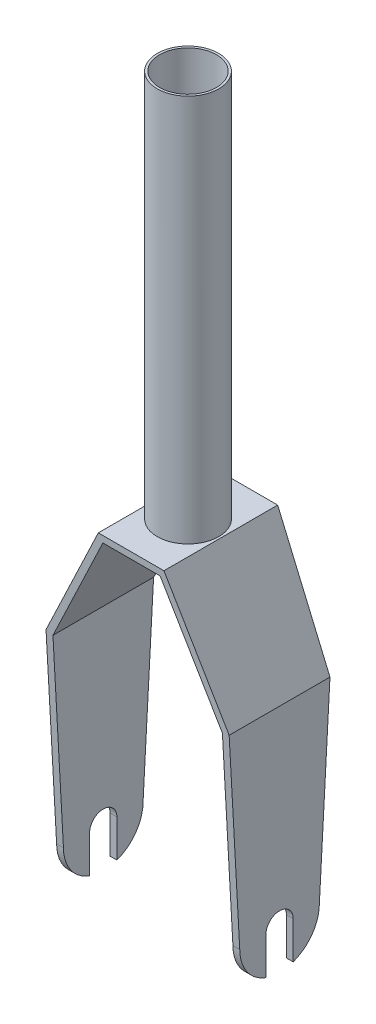
ISO-10303-21;
HEADER;
FILE_DESCRIPTION(('STEP AP214'),'2;1');
FILE_NAME('part.step','',(''),(''),'','','');
FILE_SCHEMA(('AUTOMOTIVE_DESIGN { 1 0 10303 214 1 1 1 1 }'));
ENDSEC;
DATA;
#1=APPLICATION_CONTEXT('core data for automotive mechanical design processes');
#2=APPLICATION_PROTOCOL_DEFINITION('international standard','automotive_design',2000,#1);
#3=PRODUCT_CONTEXT('',#1,'mechanical');
#4=PRODUCT('Part','Part','',(#3));
#5=PRODUCT_RELATED_PRODUCT_CATEGORY('part','',(#4));
#6=PRODUCT_DEFINITION_FORMATION('','',#4);
#7=PRODUCT_DEFINITION_CONTEXT('part definition',#1,'design');
#8=PRODUCT_DEFINITION('design','',#6,#7);
#9=PRODUCT_DEFINITION_SHAPE('','',#8);
#10=(LENGTH_UNIT() NAMED_UNIT(*) SI_UNIT(.MILLI.,.METRE.));
#11=(NAMED_UNIT(*) PLANE_ANGLE_UNIT() SI_UNIT($,.RADIAN.));
#12=(NAMED_UNIT(*) SI_UNIT($,.STERADIAN.) SOLID_ANGLE_UNIT());
#13=UNCERTAINTY_MEASURE_WITH_UNIT(LENGTH_MEASURE(1.E-05),#10,'distance_accuracy_value','');
#14=(GEOMETRIC_REPRESENTATION_CONTEXT(3) GLOBAL_UNCERTAINTY_ASSIGNED_CONTEXT((#13)) GLOBAL_UNIT_ASSIGNED_CONTEXT((#10,
#11,#12)) REPRESENTATION_CONTEXT('',''));
#15=CARTESIAN_POINT('',(0.,0.,0.));
#16=DIRECTION('',(0.,0.,1.));
#17=DIRECTION('',(1.,0.,0.));
#18=AXIS2_PLACEMENT_3D('',#15,#16,#17);
#19=CARTESIAN_POINT('',(14.6152103221235,1.49999999998596,25.));
#20=DIRECTION('',(0.,1.,0.));
#21=DIRECTION('',(-1.,0.,0.));
#22=AXIS2_PLACEMENT_3D('',#19,#20,#21);
#23=PLANE('',#22);
#24=DIRECTION('',(-1.,0.,0.));
#25=VECTOR('',#24,1.);
#26=CARTESIAN_POINT('',(14.6152103221235,1.49999999998596,24.8334082598536));
#27=LINE('',#26,#25);
#28=CARTESIAN_POINT('',(12.577081525325,1.49999999998596,24.8334082598536));
#29=VERTEX_POINT('',#28);
#30=CARTESIAN_POINT('',(-12.577081525325,1.49999999998596,24.8334082598536));
#31=VERTEX_POINT('',#30);
#32=EDGE_CURVE('E428',#29,#31,#27,.T.);
#33=ORIENTED_EDGE('',*,*,#32,.T.);
#34=DIRECTION('',(0.,0.,-1.));
#35=VECTOR('',#34,1.);
#36=CARTESIAN_POINT('',(-12.577081525325,1.49999999998596,25.));
#37=LINE('',#36,#35);
#38=CARTESIAN_POINT('',(-12.577081525325,1.49999999998596,4.90581494813335));
#39=VERTEX_POINT('',#38);
#40=EDGE_CURVE('E409',#31,#39,#37,.T.);
#41=ORIENTED_EDGE('',*,*,#40,.T.);
#42=CARTESIAN_POINT('',(0.,1.49999999998596,0.));
#43=DIRECTION('',(0.,1.,0.));
#44=DIRECTION('',(-1.,0.,0.));
#45=AXIS2_PLACEMENT_3D('',#42,#43,#44);
#46=CIRCLE('',#45,13.5);
#47=CARTESIAN_POINT('',(12.577081525325,1.49999999998596,4.90581494813333));
#48=VERTEX_POINT('',#47);
#49=EDGE_CURVE('E375',#39,#48,#46,.T.);
#50=ORIENTED_EDGE('',*,*,#49,.T.);
#51=DIRECTION('',(0.,0.,1.));
#52=VECTOR('',#51,1.);
#53=CARTESIAN_POINT('',(12.577081525325,1.49999999998596,25.));
#54=LINE('',#53,#52);
#55=EDGE_CURVE('E458',#48,#29,#54,.T.);
#56=ORIENTED_EDGE('',*,*,#55,.T.);
#57=EDGE_LOOP('',(#33,#41,#50,#56));
#58=FACE_BOUND('',#57,.T.);
#59=ADVANCED_FACE('F207',(#58),#23,.F.);
#60=CARTESIAN_POINT('',(-12.577081525325,1.49999999998596,-4.90581494813333));
#61=VERTEX_POINT('',#60);
#62=CARTESIAN_POINT('',(-12.577081525325,1.49999999998597,-24.8334082598536));
#63=VERTEX_POINT('',#62);
#64=EDGE_CURVE('E542',#61,#63,#37,.T.);
#65=ORIENTED_EDGE('',*,*,#64,.T.);
#66=DIRECTION('',(1.,0.,0.));
#67=VECTOR('',#66,1.);
#68=CARTESIAN_POINT('',(14.6152103221235,1.49999999998596,-24.8334082598536));
#69=LINE('',#68,#67);
#70=CARTESIAN_POINT('',(12.577081525325,1.49999999998596,-24.8334082598536));
#71=VERTEX_POINT('',#70);
#72=EDGE_CURVE('E438',#63,#71,#69,.T.);
#73=ORIENTED_EDGE('',*,*,#72,.T.);
#74=CARTESIAN_POINT('',(12.577081525325,1.49999999998596,-4.90581494813333));
#75=VERTEX_POINT('',#74);
#76=EDGE_CURVE('E456',#71,#75,#54,.T.);
#77=ORIENTED_EDGE('',*,*,#76,.T.);
#78=EDGE_CURVE('E464',#75,#61,#46,.T.);
#79=ORIENTED_EDGE('',*,*,#78,.T.);
#80=EDGE_LOOP('',(#65,#73,#77,#79));
#81=FACE_BOUND('',#80,.T.);
#82=ADVANCED_FACE('F576',(#81),#23,.F.);
#83=CARTESIAN_POINT('',(-40.3111828379217,-46.7638898282595,25.));
#84=DIRECTION('',(0.892634794614373,-0.450780571280259,0.));
#85=DIRECTION('',(0.450780571280259,0.892634794614373,0.));
#86=AXIS2_PLACEMENT_3D('',#83,#84,#85);
#87=PLANE('',#86);
#88=DIRECTION('',(0.450227796999917,0.891540192079043,-0.0495077440029718));
#89=VECTOR('',#88,1.);
#90=CARTESIAN_POINT('',(-41.362218395057,-48.8451483572402,-22.0377129689337));
#91=LINE('',#90,#89);
#92=CARTESIAN_POINT('',(-40.249999999986,-46.6427356937333,-22.1600142216451));
#93=VERTEX_POINT('',#92);
#94=CARTESIAN_POINT('',(-14.4229184746577,4.49999999998597,-25.));
#95=VERTEX_POINT('',#94);
#96=EDGE_CURVE('E534',#93,#95,#91,.T.);
#97=ORIENTED_EDGE('',*,*,#96,.F.);
#98=DIRECTION('',(0.,0.,1.));
#99=VECTOR('',#98,1.);
#100=CARTESIAN_POINT('',(-40.249999999986,-46.6427356937333,25.));
#101=LINE('',#100,#99);
#102=CARTESIAN_POINT('',(-40.249999999986,-46.6427356937333,22.1600142216451));
#103=VERTEX_POINT('',#102);
#104=EDGE_CURVE('E405',#93,#103,#101,.T.);
#105=ORIENTED_EDGE('',*,*,#104,.T.);
#106=DIRECTION('',(-0.450227796999917,-0.891540192079043,-0.0495077440029718));
#107=VECTOR('',#106,1.);
#108=CARTESIAN_POINT('',(-40.2477302692123,-46.6382411773497,22.1602638047469));
#109=LINE('',#108,#107);
#110=CARTESIAN_POINT('',(-14.4229184746576,4.49999999998597,25.));
#111=VERTEX_POINT('',#110);
#112=EDGE_CURVE('E537',#111,#103,#109,.T.);
#113=ORIENTED_EDGE('',*,*,#112,.F.);
#114=DIRECTION('',(0.,0.,1.));
#115=VECTOR('',#114,1.);
#116=CARTESIAN_POINT('',(-14.4229184746577,4.49999999998597,25.));
#117=LINE('',#116,#115);
#118=EDGE_CURVE('E539',#95,#111,#117,.T.);
#119=ORIENTED_EDGE('',*,*,#118,.F.);
#120=EDGE_LOOP('',(#97,#105,#113,#119));
#121=FACE_BOUND('',#120,.T.);
#122=ADVANCED_FACE('F612',(#121),#87,.F.);
#123=CARTESIAN_POINT('',(-37.6332784540786,-48.1162315421003,25.));
#124=DIRECTION('',(-0.892634794614373,0.450780571280259,0.));
#125=DIRECTION('',(-0.450780571280259,-0.892634794614373,0.));
#126=AXIS2_PLACEMENT_3D('',#123,#124,#125);
#127=PLANE('',#126);
#128=DIRECTION('',(-0.450227796999917,-0.891540192079043,0.0495077440029718));
#129=VECTOR('',#128,1.);
#130=CARTESIAN_POINT('',(-38.6826401320797,-50.1941754589343,-21.9628007114751));
#131=LINE('',#130,#129);
#132=CARTESIAN_POINT('',(-37.249999999986,-47.3572643062734,-22.1203360333293));
#133=VERTEX_POINT('',#132);
#134=EDGE_CURVE('E535',#63,#133,#131,.T.);
#135=ORIENTED_EDGE('',*,*,#134,.F.);
#136=ORIENTED_EDGE('',*,*,#64,.F.);
#137=CARTESIAN_POINT('',(0.,26.4051119313226,0.));
#138=DIRECTION('',(-0.892634794614373,0.450780571280259,0.));
#139=DIRECTION('',(-0.450780571280259,-0.892634794614373,0.));
#140=AXIS2_PLACEMENT_3D('',#137,#138,#139);
#141=ELLIPSE('',#140,29.9480520237568,13.5);
#142=CARTESIAN_POINT('',(-13.3345815253179,0.,-2.1068781513534));
#143=VERTEX_POINT('',#142);
#144=EDGE_CURVE('E379',#61,#143,#141,.T.);
#145=ORIENTED_EDGE('',*,*,#144,.T.);
#146=DIRECTION('',(0.,0.,1.));
#147=VECTOR('',#146,1.);
#148=CARTESIAN_POINT('',(-13.3345815253179,0.,0.));
#149=LINE('',#148,#147);
#150=CARTESIAN_POINT('',(-13.3345815253179,0.,2.1068781513534));
#151=VERTEX_POINT('',#150);
#152=EDGE_CURVE('E385',#143,#151,#149,.T.);
#153=ORIENTED_EDGE('',*,*,#152,.T.);
#154=EDGE_CURVE('E369',#151,#39,#141,.T.);
#155=ORIENTED_EDGE('',*,*,#154,.T.);
#156=ORIENTED_EDGE('',*,*,#40,.F.);
#157=DIRECTION('',(0.450227796999917,0.891540192079043,0.0495077440029718));
#158=VECTOR('',#157,1.);
#159=CARTESIAN_POINT('',(-37.5681520062351,-47.9872682790438,22.0853515472883));
#160=LINE('',#159,#158);
#161=CARTESIAN_POINT('',(-37.249999999986,-47.3572643062734,22.1203360333293));
#162=VERTEX_POINT('',#161);
#163=EDGE_CURVE('E538',#162,#31,#160,.T.);
#164=ORIENTED_EDGE('',*,*,#163,.F.);
#165=DIRECTION('',(0.,0.,-1.));
#166=VECTOR('',#165,1.);
#167=CARTESIAN_POINT('',(-37.249999999986,-47.3572643062733,25.));
#168=LINE('',#167,#166);
#169=EDGE_CURVE('E399',#162,#133,#168,.T.);
#170=ORIENTED_EDGE('',*,*,#169,.T.);
#171=EDGE_LOOP('',(#135,#136,#145,#153,#155,#156,#164,#170));
#172=FACE_BOUND('',#171,.T.);
#173=ADVANCED_FACE('F395',(#172),#127,.F.);
#174=CARTESIAN_POINT('',(0.,0.,0.));
#175=DIRECTION('',(0.,1.,0.));
#176=DIRECTION('',(0.,0.,1.));
#177=AXIS2_PLACEMENT_3D('',#174,#175,#176);
#178=PLANE('',#177);
#179=CARTESIAN_POINT('',(0.,0.,0.));
#180=DIRECTION('',(0.,1.,0.));
#181=DIRECTION('',(0.,0.,1.));
#182=AXIS2_PLACEMENT_3D('',#179,#180,#181);
#183=CIRCLE('',#182,12.5);
#184=CARTESIAN_POINT('',(0.,0.,12.5));
#185=VERTEX_POINT('',#184);
#186=EDGE_CURVE('E467',#185,#185,#183,.T.);
#187=ORIENTED_EDGE('',*,*,#186,.T.);
#188=EDGE_LOOP('',(#187));
#189=FACE_BOUND('',#188,.T.);
#190=ORIENTED_EDGE('',*,*,#152,.F.);
#191=CARTESIAN_POINT('',(0.,0.,0.));
#192=DIRECTION('',(0.,1.,0.));
#193=DIRECTION('',(0.,0.,1.));
#194=AXIS2_PLACEMENT_3D('',#191,#192,#193);
#195=CIRCLE('',#194,13.5);
#196=CARTESIAN_POINT('',(13.3345815253179,0.,-2.1068781513534));
#197=VERTEX_POINT('',#196);
#198=EDGE_CURVE('E390',#197,#143,#195,.T.);
#199=ORIENTED_EDGE('',*,*,#198,.F.);
#200=DIRECTION('',(0.,0.,-1.));
#201=VECTOR('',#200,1.);
#202=CARTESIAN_POINT('',(13.3345815253179,0.,0.));
#203=LINE('',#202,#201);
#204=CARTESIAN_POINT('',(13.3345815253179,0.,2.1068781513534));
#205=VERTEX_POINT('',#204);
#206=EDGE_CURVE('E388',#205,#197,#203,.T.);
#207=ORIENTED_EDGE('',*,*,#206,.F.);
#208=EDGE_CURVE('E372',#151,#205,#195,.T.);
#209=ORIENTED_EDGE('',*,*,#208,.F.);
#210=EDGE_LOOP('',(#190,#199,#207,#209));
#211=FACE_BOUND('',#210,.T.);
#212=ADVANCED_FACE('F383',(#189,#211),#178,.F.);
#213=CARTESIAN_POINT('',(0.,175.,0.));
#214=DIRECTION('',(0.,-1.,0.));
#215=DIRECTION('',(0.,0.,-1.));
#216=AXIS2_PLACEMENT_3D('',#213,#214,#215);
#217=CYLINDRICAL_SURFACE('',#216,13.5);
#218=CARTESIAN_POINT('',(0.,175.,0.));
#219=DIRECTION('',(0.,1.,0.));
#220=DIRECTION('',(0.,0.,1.));
#221=AXIS2_PLACEMENT_3D('',#218,#219,#220);
#222=CIRCLE('',#221,13.5);
#223=CARTESIAN_POINT('',(0.,175.,13.5));
#224=VERTEX_POINT('',#223);
#225=EDGE_CURVE('E472',#224,#224,#222,.T.);
#226=ORIENTED_EDGE('',*,*,#225,.F.);
#227=EDGE_LOOP('',(#226));
#228=FACE_BOUND('',#227,.T.);
#229=CARTESIAN_POINT('',(0.,4.49999999998596,0.));
#230=DIRECTION('',(0.,-1.,0.));
#231=DIRECTION('',(1.,0.,0.));
#232=AXIS2_PLACEMENT_3D('',#229,#230,#231);
#233=CIRCLE('',#232,13.5);
#234=CARTESIAN_POINT('',(13.5,4.49999999998596,0.));
#235=VERTEX_POINT('',#234);
#236=EDGE_CURVE('E452',#235,#235,#233,.T.);
#237=ORIENTED_EDGE('',*,*,#236,.F.);
#238=EDGE_LOOP('',(#237));
#239=FACE_BOUND('',#238,.T.);
#240=ADVANCED_FACE('F209',(#228,#239),#217,.T.);
#241=ORIENTED_EDGE('',*,*,#144,.F.);
#242=ORIENTED_EDGE('',*,*,#78,.F.);
#243=CARTESIAN_POINT('',(0.,26.4051119313226,0.));
#244=DIRECTION('',(0.892634794614373,0.450780571280259,0.));
#245=DIRECTION('',(0.450780571280259,-0.892634794614373,0.));
#246=AXIS2_PLACEMENT_3D('',#243,#244,#245);
#247=ELLIPSE('',#246,29.9480520237568,13.5);
#248=EDGE_CURVE('E474',#197,#75,#247,.T.);
#249=ORIENTED_EDGE('',*,*,#248,.F.);
#250=ORIENTED_EDGE('',*,*,#198,.T.);
#251=EDGE_LOOP('',(#241,#242,#249,#250));
#252=FACE_BOUND('',#251,.T.);
#253=ADVANCED_FACE('F635',(#252),#217,.T.);
#254=ORIENTED_EDGE('',*,*,#49,.F.);
#255=ORIENTED_EDGE('',*,*,#154,.F.);
#256=ORIENTED_EDGE('',*,*,#208,.T.);
#257=EDGE_CURVE('E478',#48,#205,#247,.T.);
#258=ORIENTED_EDGE('',*,*,#257,.F.);
#259=EDGE_LOOP('',(#254,#255,#256,#258));
#260=FACE_BOUND('',#259,.T.);
#261=ADVANCED_FACE('F371',(#260),#217,.T.);
#262=CARTESIAN_POINT('',(0.,175.,0.));
#263=DIRECTION('',(0.,-1.,0.));
#264=DIRECTION('',(0.,0.,-1.));
#265=AXIS2_PLACEMENT_3D('',#262,#263,#264);
#266=CYLINDRICAL_SURFACE('',#265,12.5);
#267=CARTESIAN_POINT('',(0.,175.,0.));
#268=DIRECTION('',(0.,1.,0.));
#269=DIRECTION('',(0.,0.,1.));
#270=AXIS2_PLACEMENT_3D('',#267,#268,#269);
#271=CIRCLE('',#270,12.5);
#272=CARTESIAN_POINT('',(0.,175.,12.5));
#273=VERTEX_POINT('',#272);
#274=EDGE_CURVE('E391',#273,#273,#271,.T.);
#275=ORIENTED_EDGE('',*,*,#274,.T.);
#276=EDGE_LOOP('',(#275));
#277=FACE_BOUND('',#276,.T.);
#278=ORIENTED_EDGE('',*,*,#186,.F.);
#279=EDGE_LOOP('',(#278));
#280=FACE_BOUND('',#279,.T.);
#281=ADVANCED_FACE('F673',(#277,#280),#266,.F.);
#282=CARTESIAN_POINT('',(40.249999999986,-147.,25.));
#283=DIRECTION('',(-1.,0.,0.));
#284=DIRECTION('',(0.,-1.,0.));
#285=AXIS2_PLACEMENT_3D('',#282,#283,#284);
#286=PLANE('',#285);
#287=CARTESIAN_POINT('',(40.249999999986,-130.560717777209,2.45113194250125E-11));
#288=DIRECTION('',(1.,0.,0.));
#289=DIRECTION('',(0.,1.,0.));
#290=AXIS2_PLACEMENT_3D('',#287,#288,#289);
#291=CIRCLE('',#290,17.5000000000329);
#292=CARTESIAN_POINT('',(40.249999999986,-147.000000000009,-5.99999999997549));
#293=VERTEX_POINT('',#292);
#294=CARTESIAN_POINT('',(40.249999999986,-130.560717777354,-17.5000000000165));
#295=VERTEX_POINT('',#294);
#296=EDGE_CURVE('E439',#293,#295,#291,.T.);
#297=ORIENTED_EDGE('',*,*,#296,.T.);
#298=DIRECTION('',(0.,0.998461734026933,-0.0554451592470507));
#299=VECTOR('',#298,1.);
#300=CARTESIAN_POINT('',(40.249999999986,-149.302257391145,-16.459271434255));
#301=LINE('',#300,#299);
#302=CARTESIAN_POINT('',(40.249999999986,-46.6427356937333,-22.1600142216451));
#303=VERTEX_POINT('',#302);
#304=EDGE_CURVE('E442',#295,#303,#301,.T.);
#305=ORIENTED_EDGE('',*,*,#304,.T.);
#306=DIRECTION('',(0.,0.,-1.));
#307=VECTOR('',#306,1.);
#308=CARTESIAN_POINT('',(40.249999999986,-46.6427356937333,25.));
#309=LINE('',#308,#307);
#310=CARTESIAN_POINT('',(40.249999999986,-46.6427356937333,22.1600142216451));
#311=VERTEX_POINT('',#310);
#312=EDGE_CURVE('E453',#311,#303,#309,.T.);
#313=ORIENTED_EDGE('',*,*,#312,.F.);
#314=DIRECTION('',(0.,-0.998461734026933,-0.0554451592470507));
#315=VECTOR('',#314,1.);
#316=CARTESIAN_POINT('',(40.249999999986,-146.534263898885,16.6129797184515));
#317=LINE('',#316,#315);
#318=CARTESIAN_POINT('',(40.249999999986,-130.560717777209,17.5000000000245));
#319=VERTEX_POINT('',#318);
#320=EDGE_CURVE('E430',#311,#319,#317,.T.);
#321=ORIENTED_EDGE('',*,*,#320,.T.);
#322=CARTESIAN_POINT('',(40.249999999986,-130.560717777209,2.45113194250125E-11));
#323=DIRECTION('',(1.,0.,0.));
#324=DIRECTION('',(0.,1.,0.));
#325=AXIS2_PLACEMENT_3D('',#322,#323,#324);
#326=CIRCLE('',#325,17.5);
#327=CARTESIAN_POINT('',(40.249999999986,-147.,5.99999999997549));
#328=VERTEX_POINT('',#327);
#329=EDGE_CURVE('E434',#319,#328,#326,.T.);
#330=ORIENTED_EDGE('',*,*,#329,.T.);
#331=DIRECTION('',(0.,-1.,0.));
#332=VECTOR('',#331,1.);
#333=CARTESIAN_POINT('',(40.249999999986,0.,5.99999999997551));
#334=LINE('',#333,#332);
#335=CARTESIAN_POINT('',(40.249999999986,-130.560717777209,5.99999999997549));
#336=VERTEX_POINT('',#335);
#337=EDGE_CURVE('E509',#336,#328,#334,.T.);
#338=ORIENTED_EDGE('',*,*,#337,.F.);
#339=CARTESIAN_POINT('',(40.249999999986,-130.560717777209,2.45113194250125E-11));
#340=DIRECTION('',(1.,0.,0.));
#341=DIRECTION('',(0.,1.,0.));
#342=AXIS2_PLACEMENT_3D('',#339,#340,#341);
#343=CIRCLE('',#342,5.99999999997549);
#344=CARTESIAN_POINT('',(40.249999999986,-130.560717777209,-5.99999999997549));
#345=VERTEX_POINT('',#344);
#346=EDGE_CURVE('E511',#345,#336,#343,.T.);
#347=ORIENTED_EDGE('',*,*,#346,.F.);
#348=DIRECTION('',(0.,-1.,0.));
#349=VECTOR('',#348,1.);
#350=CARTESIAN_POINT('',(40.249999999986,-147.,-5.99999999997549));
#351=LINE('',#350,#349);
#352=EDGE_CURVE('E513',#345,#293,#351,.T.);
#353=ORIENTED_EDGE('',*,*,#352,.T.);
#354=EDGE_LOOP('',(#297,#305,#313,#321,#330,#338,#347,#353));
#355=FACE_BOUND('',#354,.T.);
#356=ADVANCED_FACE('F622',(#355),#286,.F.);
#357=CARTESIAN_POINT('',(37.249999999986,-147.,25.));
#358=DIRECTION('',(1.,0.,0.));
#359=DIRECTION('',(0.,1.,0.));
#360=AXIS2_PLACEMENT_3D('',#357,#358,#359);
#361=PLANE('',#360);
#362=DIRECTION('',(0.,0.,1.));
#363=VECTOR('',#362,1.);
#364=CARTESIAN_POINT('',(37.249999999986,-47.3572643062733,25.));
#365=LINE('',#364,#363);
#366=CARTESIAN_POINT('',(37.249999999986,-47.3572643062734,-22.1203360333293));
#367=VERTEX_POINT('',#366);
#368=CARTESIAN_POINT('',(37.249999999986,-47.3572643062733,22.1203360333293));
#369=VERTEX_POINT('',#368);
#370=EDGE_CURVE('E449',#367,#369,#365,.T.);
#371=ORIENTED_EDGE('',*,*,#370,.F.);
#372=DIRECTION('',(0.,-0.998461734026933,0.0554451592470507));
#373=VECTOR('',#372,1.);
#374=CARTESIAN_POINT('',(37.249999999986,-149.302257391145,-16.459271434255));
#375=LINE('',#374,#373);
#376=CARTESIAN_POINT('',(37.249999999986,-130.560717777209,-17.5000000000245));
#377=VERTEX_POINT('',#376);
#378=EDGE_CURVE('E380',#367,#377,#375,.T.);
#379=ORIENTED_EDGE('',*,*,#378,.T.);
#380=CARTESIAN_POINT('',(37.249999999986,-130.560717777209,2.45113194250125E-11));
#381=DIRECTION('',(1.,0.,0.));
#382=DIRECTION('',(0.,1.,0.));
#383=AXIS2_PLACEMENT_3D('',#380,#381,#382);
#384=CIRCLE('',#383,17.5000000000329);
#385=CARTESIAN_POINT('',(37.249999999986,-147.,-5.99999999997549));
#386=VERTEX_POINT('',#385);
#387=EDGE_CURVE('E492',#386,#377,#384,.T.);
#388=ORIENTED_EDGE('',*,*,#387,.F.);
#389=DIRECTION('',(0.,-1.,0.));
#390=VECTOR('',#389,1.);
#391=CARTESIAN_POINT('',(37.249999999986,-147.,-5.99999999997549));
#392=LINE('',#391,#390);
#393=CARTESIAN_POINT('',(37.249999999986,-130.560717777209,-5.99999999997549));
#394=VERTEX_POINT('',#393);
#395=EDGE_CURVE('E490',#394,#386,#392,.T.);
#396=ORIENTED_EDGE('',*,*,#395,.F.);
#397=CARTESIAN_POINT('',(37.249999999986,-130.560717777209,2.45113194250125E-11));
#398=DIRECTION('',(1.,0.,0.));
#399=DIRECTION('',(0.,1.,0.));
#400=AXIS2_PLACEMENT_3D('',#397,#398,#399);
#401=CIRCLE('',#400,5.99999999997549);
#402=CARTESIAN_POINT('',(37.249999999986,-130.560717777209,5.99999999997549));
#403=VERTEX_POINT('',#402);
#404=EDGE_CURVE('E487',#394,#403,#401,.T.);
#405=ORIENTED_EDGE('',*,*,#404,.T.);
#406=DIRECTION('',(0.,-1.,0.));
#407=VECTOR('',#406,1.);
#408=CARTESIAN_POINT('',(37.249999999986,-147.,5.99999999997549));
#409=LINE('',#408,#407);
#410=CARTESIAN_POINT('',(37.249999999986,-147.,5.99999999997549));
#411=VERTEX_POINT('',#410);
#412=EDGE_CURVE('E484',#403,#411,#409,.T.);
#413=ORIENTED_EDGE('',*,*,#412,.T.);
#414=CARTESIAN_POINT('',(37.249999999986,-130.560717777209,2.45113194250125E-11));
#415=DIRECTION('',(1.,0.,0.));
#416=DIRECTION('',(0.,1.,0.));
#417=AXIS2_PLACEMENT_3D('',#414,#415,#416);
#418=CIRCLE('',#417,17.5);
#419=CARTESIAN_POINT('',(37.249999999986,-130.560717777209,17.5000000000245));
#420=VERTEX_POINT('',#419);
#421=EDGE_CURVE('E482',#420,#411,#418,.T.);
#422=ORIENTED_EDGE('',*,*,#421,.F.);
#423=DIRECTION('',(0.,0.998461734026933,0.0554451592470507));
#424=VECTOR('',#423,1.);
#425=CARTESIAN_POINT('',(37.249999999986,-146.534263898885,16.6129797184515));
#426=LINE('',#425,#424);
#427=EDGE_CURVE('E479',#420,#369,#426,.T.);
#428=ORIENTED_EDGE('',*,*,#427,.T.);
#429=EDGE_LOOP('',(#371,#379,#388,#396,#405,#413,#422,#428));
#430=FACE_BOUND('',#429,.T.);
#431=ADVANCED_FACE('F631',(#430),#361,.F.);
#432=CARTESIAN_POINT('',(0.,175.,0.));
#433=DIRECTION('',(0.,1.,0.));
#434=DIRECTION('',(0.,0.,1.));
#435=AXIS2_PLACEMENT_3D('',#432,#433,#434);
#436=PLANE('',#435);
#437=ORIENTED_EDGE('',*,*,#225,.T.);
#438=EDGE_LOOP('',(#437));
#439=FACE_BOUND('',#438,.T.);
#440=ORIENTED_EDGE('',*,*,#274,.F.);
#441=EDGE_LOOP('',(#440));
#442=FACE_BOUND('',#441,.T.);
#443=ADVANCED_FACE('F672',(#439,#442),#436,.T.);
#444=CARTESIAN_POINT('',(14.6152103221235,4.49999999998596,25.));
#445=DIRECTION('',(0.,-1.,0.));
#446=DIRECTION('',(1.,0.,0.));
#447=AXIS2_PLACEMENT_3D('',#444,#445,#446);
#448=PLANE('',#447);
#449=ORIENTED_EDGE('',*,*,#118,.T.);
#450=DIRECTION('',(-1.,0.,0.));
#451=VECTOR('',#450,1.);
#452=CARTESIAN_POINT('',(14.6152103221235,4.49999999998596,25.));
#453=LINE('',#452,#451);
#454=CARTESIAN_POINT('',(14.4229184746576,4.49999999998597,25.));
#455=VERTEX_POINT('',#454);
#456=EDGE_CURVE('E459',#455,#111,#453,.T.);
#457=ORIENTED_EDGE('',*,*,#456,.F.);
#458=DIRECTION('',(0.,0.,-1.));
#459=VECTOR('',#458,1.);
#460=CARTESIAN_POINT('',(14.4229184746577,4.49999999998597,25.));
#461=LINE('',#460,#459);
#462=CARTESIAN_POINT('',(14.4229184746577,4.49999999998597,-25.));
#463=VERTEX_POINT('',#462);
#464=EDGE_CURVE('E461',#455,#463,#461,.T.);
#465=ORIENTED_EDGE('',*,*,#464,.T.);
#466=DIRECTION('',(-1.,0.,0.));
#467=VECTOR('',#466,1.);
#468=CARTESIAN_POINT('',(14.6152103221235,4.49999999998596,-25.));
#469=LINE('',#468,#467);
#470=EDGE_CURVE('E446',#463,#95,#469,.T.);
#471=ORIENTED_EDGE('',*,*,#470,.T.);
#472=EDGE_LOOP('',(#449,#457,#465,#471));
#473=FACE_BOUND('',#472,.T.);
#474=ORIENTED_EDGE('',*,*,#236,.T.);
#475=EDGE_LOOP('',(#474));
#476=FACE_BOUND('',#475,.T.);
#477=ADVANCED_FACE('F615',(#473,#476),#448,.F.);
#478=CARTESIAN_POINT('',(40.3111828379217,-46.7638898282595,25.));
#479=DIRECTION('',(-0.892634794614373,-0.450780571280259,0.));
#480=DIRECTION('',(0.450780571280259,-0.892634794614373,0.));
#481=AXIS2_PLACEMENT_3D('',#478,#479,#480);
#482=PLANE('',#481);
#483=ORIENTED_EDGE('',*,*,#312,.T.);
#484=DIRECTION('',(-0.450227796999917,0.891540192079043,-0.0495077440029718));
#485=VECTOR('',#484,1.);
#486=CARTESIAN_POINT('',(41.362218395057,-48.8451483572402,-22.0377129689337));
#487=LINE('',#486,#485);
#488=EDGE_CURVE('E443',#303,#463,#487,.T.);
#489=ORIENTED_EDGE('',*,*,#488,.T.);
#490=ORIENTED_EDGE('',*,*,#464,.F.);
#491=DIRECTION('',(0.450227796999917,-0.891540192079043,-0.0495077440029718));
#492=VECTOR('',#491,1.);
#493=CARTESIAN_POINT('',(40.2477302692123,-46.6382411773497,22.1602638047469));
#494=LINE('',#493,#492);
#495=EDGE_CURVE('E431',#455,#311,#494,.T.);
#496=ORIENTED_EDGE('',*,*,#495,.T.);
#497=EDGE_LOOP('',(#483,#489,#490,#496));
#498=FACE_BOUND('',#497,.T.);
#499=ADVANCED_FACE('F619',(#498),#482,.F.);
#500=CARTESIAN_POINT('',(37.6332784540786,-48.1162315421003,25.));
#501=DIRECTION('',(0.892634794614373,0.450780571280259,0.));
#502=DIRECTION('',(-0.450780571280259,0.892634794614373,0.));
#503=AXIS2_PLACEMENT_3D('',#500,#501,#502);
#504=PLANE('',#503);
#505=ORIENTED_EDGE('',*,*,#76,.F.);
#506=DIRECTION('',(0.450227796999917,-0.891540192079043,0.0495077440029718));
#507=VECTOR('',#506,1.);
#508=CARTESIAN_POINT('',(38.6826401320797,-50.1941754589343,-21.9628007114751));
#509=LINE('',#508,#507);
#510=EDGE_CURVE('E435',#71,#367,#509,.T.);
#511=ORIENTED_EDGE('',*,*,#510,.T.);
#512=ORIENTED_EDGE('',*,*,#370,.T.);
#513=DIRECTION('',(-0.450227796999917,0.891540192079043,0.0495077440029718));
#514=VECTOR('',#513,1.);
#515=CARTESIAN_POINT('',(37.5681520062351,-47.9872682790438,22.0853515472883));
#516=LINE('',#515,#514);
#517=EDGE_CURVE('E413',#369,#29,#516,.T.);
#518=ORIENTED_EDGE('',*,*,#517,.T.);
#519=ORIENTED_EDGE('',*,*,#55,.F.);
#520=ORIENTED_EDGE('',*,*,#257,.T.);
#521=ORIENTED_EDGE('',*,*,#206,.T.);
#522=ORIENTED_EDGE('',*,*,#248,.T.);
#523=EDGE_LOOP('',(#505,#511,#512,#518,#519,#520,#521,#522));
#524=FACE_BOUND('',#523,.T.);
#525=ADVANCED_FACE('F633',(#524),#504,.F.);
#526=CARTESIAN_POINT('',(-109.750000000014,-1.37016300055261,-24.6740264435991));
#527=DIRECTION('',(0.,0.0554451592470507,0.998461734026933));
#528=DIRECTION('',(0.,-0.998461734026933,0.0554451592470507));
#529=AXIS2_PLACEMENT_3D('',#526,#527,#528);
#530=PLANE('',#529);
#531=ORIENTED_EDGE('',*,*,#304,.F.);
#532=DIRECTION('',(1.,0.,0.));
#533=VECTOR('',#532,1.);
#534=CARTESIAN_POINT('',(-109.750000000014,-130.560717777209,-17.5000000000245));
#535=LINE('',#534,#533);
#536=EDGE_CURVE('E411',#377,#295,#535,.T.);
#537=ORIENTED_EDGE('',*,*,#536,.F.);
#538=ORIENTED_EDGE('',*,*,#378,.F.);
#539=ORIENTED_EDGE('',*,*,#510,.F.);
#540=ORIENTED_EDGE('',*,*,#72,.F.);
#541=ORIENTED_EDGE('',*,*,#134,.T.);
#542=DIRECTION('',(0.,-0.998461734026933,0.0554451592470507));
#543=VECTOR('',#542,1.);
#544=CARTESIAN_POINT('',(-37.249999999986,-149.302257391145,-16.459271434255));
#545=LINE('',#544,#543);
#546=CARTESIAN_POINT('',(-37.249999999986,-130.560717777354,-17.5000000000084));
#547=VERTEX_POINT('',#546);
#548=EDGE_CURVE('E13',#133,#547,#545,.T.);
#549=ORIENTED_EDGE('',*,*,#548,.T.);
#550=DIRECTION('',(-1.,0.,0.));
#551=VECTOR('',#550,1.);
#552=CARTESIAN_POINT('',(109.750000000014,-130.560717777209,-17.5000000000245));
#553=LINE('',#552,#551);
#554=CARTESIAN_POINT('',(-40.249999999986,-130.560717777354,-17.5000000000165));
#555=VERTEX_POINT('',#554);
#556=EDGE_CURVE('E226',#547,#555,#553,.T.);
#557=ORIENTED_EDGE('',*,*,#556,.T.);
#558=DIRECTION('',(0.,0.998461734026933,-0.0554451592470507));
#559=VECTOR('',#558,1.);
#560=CARTESIAN_POINT('',(-40.249999999986,-149.302257391145,-16.459271434255));
#561=LINE('',#560,#559);
#562=EDGE_CURVE('E532',#555,#93,#561,.T.);
#563=ORIENTED_EDGE('',*,*,#562,.T.);
#564=ORIENTED_EDGE('',*,*,#96,.T.);
#565=ORIENTED_EDGE('',*,*,#470,.F.);
#566=ORIENTED_EDGE('',*,*,#488,.F.);
#567=EDGE_LOOP('',(#531,#537,#538,#539,#540,#541,#549,#557,#563,#564,#565,#566));
#568=FACE_BOUND('',#567,.T.);
#569=ADVANCED_FACE('F582',(#568),#530,.F.);
#570=CARTESIAN_POINT('',(-109.750000000014,-130.560717777209,2.45113194250125E-11));
#571=DIRECTION('',(1.,0.,0.));
#572=DIRECTION('',(0.,1.,0.));
#573=AXIS2_PLACEMENT_3D('',#570,#571,#572);
#574=CYLINDRICAL_SURFACE('',#573,17.5000000000329);
#575=ORIENTED_EDGE('',*,*,#296,.F.);
#576=DIRECTION('',(1.,0.,0.));
#577=VECTOR('',#576,1.);
#578=CARTESIAN_POINT('',(-109.750000000014,-147.,-5.99999999997549));
#579=LINE('',#578,#577);
#580=EDGE_CURVE('E414',#386,#293,#579,.T.);
#581=ORIENTED_EDGE('',*,*,#580,.F.);
#582=ORIENTED_EDGE('',*,*,#387,.T.);
#583=ORIENTED_EDGE('',*,*,#536,.T.);
#584=EDGE_LOOP('',(#575,#581,#582,#583));
#585=FACE_BOUND('',#584,.T.);
#586=ADVANCED_FACE('F625',(#585),#574,.T.);
#587=CARTESIAN_POINT('',(-109.750000000014,0.,-5.99999999997551));
#588=DIRECTION('',(0.,0.,1.));
#589=DIRECTION('',(0.,-1.,0.));
#590=AXIS2_PLACEMENT_3D('',#587,#588,#589);
#591=PLANE('',#590);
#592=ORIENTED_EDGE('',*,*,#352,.F.);
#593=DIRECTION('',(1.,0.,0.));
#594=VECTOR('',#593,1.);
#595=CARTESIAN_POINT('',(-109.750000000014,-130.560717777209,-5.99999999997549));
#596=LINE('',#595,#594);
#597=EDGE_CURVE('E421',#394,#345,#596,.T.);
#598=ORIENTED_EDGE('',*,*,#597,.F.);
#599=ORIENTED_EDGE('',*,*,#395,.T.);
#600=ORIENTED_EDGE('',*,*,#580,.T.);
#601=EDGE_LOOP('',(#592,#598,#599,#600));
#602=FACE_BOUND('',#601,.T.);
#603=ADVANCED_FACE('F653',(#602),#591,.T.);
#604=CARTESIAN_POINT('',(-109.750000000014,-130.560717777209,2.45113194250125E-11));
#605=DIRECTION('',(1.,0.,0.));
#606=DIRECTION('',(0.,1.,0.));
#607=AXIS2_PLACEMENT_3D('',#604,#605,#606);
#608=CYLINDRICAL_SURFACE('',#607,5.99999999997549);
#609=DIRECTION('',(1.,0.,0.));
#610=VECTOR('',#609,1.);
#611=CARTESIAN_POINT('',(-109.750000000014,-130.560717777209,5.99999999997549));
#612=LINE('',#611,#610);
#613=EDGE_CURVE('E418',#403,#336,#612,.T.);
#614=ORIENTED_EDGE('',*,*,#613,.F.);
#615=ORIENTED_EDGE('',*,*,#404,.F.);
#616=ORIENTED_EDGE('',*,*,#597,.T.);
#617=ORIENTED_EDGE('',*,*,#346,.T.);
#618=EDGE_LOOP('',(#614,#615,#616,#617));
#619=FACE_BOUND('',#618,.T.);
#620=ADVANCED_FACE('F650',(#619),#608,.F.);
#621=CARTESIAN_POINT('',(-109.750000000014,0.,5.99999999997551));
#622=DIRECTION('',(0.,0.,1.));
#623=DIRECTION('',(0.,-1.,0.));
#624=AXIS2_PLACEMENT_3D('',#621,#622,#623);
#625=PLANE('',#624);
#626=DIRECTION('',(1.,0.,0.));
#627=VECTOR('',#626,1.);
#628=CARTESIAN_POINT('',(-109.750000000014,-147.,5.99999999997549));
#629=LINE('',#628,#627);
#630=EDGE_CURVE('E402',#411,#328,#629,.T.);
#631=ORIENTED_EDGE('',*,*,#630,.F.);
#632=ORIENTED_EDGE('',*,*,#412,.F.);
#633=ORIENTED_EDGE('',*,*,#613,.T.);
#634=ORIENTED_EDGE('',*,*,#337,.T.);
#635=EDGE_LOOP('',(#631,#632,#633,#634));
#636=FACE_BOUND('',#635,.T.);
#637=ADVANCED_FACE('F645',(#636),#625,.F.);
#638=CARTESIAN_POINT('',(-109.750000000014,-130.560717777209,2.45113194250125E-11));
#639=DIRECTION('',(1.,0.,0.));
#640=DIRECTION('',(0.,1.,0.));
#641=AXIS2_PLACEMENT_3D('',#638,#639,#640);
#642=CYLINDRICAL_SURFACE('',#641,17.5);
#643=ORIENTED_EDGE('',*,*,#329,.F.);
#644=DIRECTION('',(1.,0.,0.));
#645=VECTOR('',#644,1.);
#646=CARTESIAN_POINT('',(-109.750000000014,-130.560717777209,17.5000000000245));
#647=LINE('',#646,#645);
#648=EDGE_CURVE('E398',#420,#319,#647,.T.);
#649=ORIENTED_EDGE('',*,*,#648,.F.);
#650=ORIENTED_EDGE('',*,*,#421,.T.);
#651=ORIENTED_EDGE('',*,*,#630,.T.);
#652=EDGE_LOOP('',(#643,#649,#650,#651));
#653=FACE_BOUND('',#652,.T.);
#654=ADVANCED_FACE('F643',(#653),#642,.T.);
#655=CARTESIAN_POINT('',(-109.750000000014,-1.37016300055261,24.6740264435991));
#656=DIRECTION('',(0.,0.0554451592470507,-0.998461734026933));
#657=DIRECTION('',(0.,0.998461734026933,0.0554451592470507));
#658=AXIS2_PLACEMENT_3D('',#655,#656,#657);
#659=PLANE('',#658);
#660=ORIENTED_EDGE('',*,*,#456,.T.);
#661=ORIENTED_EDGE('',*,*,#112,.T.);
#662=DIRECTION('',(0.,-0.998461734026933,-0.0554451592470507));
#663=VECTOR('',#662,1.);
#664=CARTESIAN_POINT('',(-40.249999999986,-146.534263898885,16.6129797184515));
#665=LINE('',#664,#663);
#666=CARTESIAN_POINT('',(-40.249999999986,-130.560717777209,17.5000000000245));
#667=VERTEX_POINT('',#666);
#668=EDGE_CURVE('E254',#103,#667,#665,.T.);
#669=ORIENTED_EDGE('',*,*,#668,.T.);
#670=DIRECTION('',(-1.,0.,0.));
#671=VECTOR('',#670,1.);
#672=CARTESIAN_POINT('',(109.750000000014,-130.560717777209,17.5000000000245));
#673=LINE('',#672,#671);
#674=CARTESIAN_POINT('',(-37.249999999986,-130.560717777209,17.5000000000245));
#675=VERTEX_POINT('',#674);
#676=EDGE_CURVE('E548',#675,#667,#673,.T.);
#677=ORIENTED_EDGE('',*,*,#676,.F.);
#678=DIRECTION('',(0.,0.998461734026933,0.0554451592470507));
#679=VECTOR('',#678,1.);
#680=CARTESIAN_POINT('',(-37.249999999986,-146.534263898885,16.6129797184515));
#681=LINE('',#680,#679);
#682=EDGE_CURVE('E217',#675,#162,#681,.T.);
#683=ORIENTED_EDGE('',*,*,#682,.T.);
#684=ORIENTED_EDGE('',*,*,#163,.T.);
#685=ORIENTED_EDGE('',*,*,#32,.F.);
#686=ORIENTED_EDGE('',*,*,#517,.F.);
#687=ORIENTED_EDGE('',*,*,#427,.F.);
#688=ORIENTED_EDGE('',*,*,#648,.T.);
#689=ORIENTED_EDGE('',*,*,#320,.F.);
#690=ORIENTED_EDGE('',*,*,#495,.F.);
#691=EDGE_LOOP('',(#660,#661,#669,#677,#683,#684,#685,#686,#687,#688,#689,#690));
#692=FACE_BOUND('',#691,.T.);
#693=ADVANCED_FACE('F638',(#692),#659,.F.);
#694=CARTESIAN_POINT('',(-40.249999999986,-147.,25.));
#695=DIRECTION('',(1.,0.,0.));
#696=DIRECTION('',(0.,1.,0.));
#697=AXIS2_PLACEMENT_3D('',#694,#695,#696);
#698=PLANE('',#697);
#699=ORIENTED_EDGE('',*,*,#562,.F.);
#700=CARTESIAN_POINT('',(-40.249999999986,-130.560717777209,2.45113194250125E-11));
#701=DIRECTION('',(-1.,0.,0.));
#702=DIRECTION('',(0.,-1.,0.));
#703=AXIS2_PLACEMENT_3D('',#700,#701,#702);
#704=CIRCLE('',#703,17.5000000000329);
#705=CARTESIAN_POINT('',(-40.249999999986,-147.000000000009,-5.99999999997549));
#706=VERTEX_POINT('',#705);
#707=EDGE_CURVE('E545',#706,#555,#704,.F.);
#708=ORIENTED_EDGE('',*,*,#707,.F.);
#709=DIRECTION('',(0.,1.,0.));
#710=VECTOR('',#709,1.);
#711=CARTESIAN_POINT('',(-40.249999999986,0.,-5.99999999997551));
#712=LINE('',#711,#710);
#713=CARTESIAN_POINT('',(-40.249999999986,-130.560717777209,-5.99999999997549));
#714=VERTEX_POINT('',#713);
#715=EDGE_CURVE('E547',#714,#706,#712,.F.);
#716=ORIENTED_EDGE('',*,*,#715,.F.);
#717=CARTESIAN_POINT('',(-40.249999999986,-130.560717777209,2.45113194250125E-11));
#718=DIRECTION('',(-1.,0.,0.));
#719=DIRECTION('',(0.,-1.,0.));
#720=AXIS2_PLACEMENT_3D('',#717,#718,#719);
#721=CIRCLE('',#720,5.99999999997549);
#722=CARTESIAN_POINT('',(-40.249999999986,-130.560717777209,5.99999999997549));
#723=VERTEX_POINT('',#722);
#724=EDGE_CURVE('E550',#714,#723,#721,.F.);
#725=ORIENTED_EDGE('',*,*,#724,.T.);
#726=DIRECTION('',(0.,1.,0.));
#727=VECTOR('',#726,1.);
#728=CARTESIAN_POINT('',(-40.249999999986,-147.,5.99999999997549));
#729=LINE('',#728,#727);
#730=CARTESIAN_POINT('',(-40.249999999986,-147.,5.99999999997549));
#731=VERTEX_POINT('',#730);
#732=EDGE_CURVE('E552',#723,#731,#729,.F.);
#733=ORIENTED_EDGE('',*,*,#732,.T.);
#734=CARTESIAN_POINT('',(-40.249999999986,-130.560717777209,2.45113194250125E-11));
#735=DIRECTION('',(-1.,0.,0.));
#736=DIRECTION('',(0.,-1.,0.));
#737=AXIS2_PLACEMENT_3D('',#734,#735,#736);
#738=CIRCLE('',#737,17.5);
#739=EDGE_CURVE('E211',#667,#731,#738,.F.);
#740=ORIENTED_EDGE('',*,*,#739,.F.);
#741=ORIENTED_EDGE('',*,*,#668,.F.);
#742=ORIENTED_EDGE('',*,*,#104,.F.);
#743=EDGE_LOOP('',(#699,#708,#716,#725,#733,#740,#741,#742));
#744=FACE_BOUND('',#743,.T.);
#745=ADVANCED_FACE('F610',(#744),#698,.F.);
#746=CARTESIAN_POINT('',(-37.249999999986,-147.,25.));
#747=DIRECTION('',(-1.,0.,0.));
#748=DIRECTION('',(0.,-1.,0.));
#749=AXIS2_PLACEMENT_3D('',#746,#747,#748);
#750=PLANE('',#749);
#751=ORIENTED_EDGE('',*,*,#548,.F.);
#752=ORIENTED_EDGE('',*,*,#169,.F.);
#753=ORIENTED_EDGE('',*,*,#682,.F.);
#754=CARTESIAN_POINT('',(-37.249999999986,-130.560717777209,2.45113194250125E-11));
#755=DIRECTION('',(-1.,0.,0.));
#756=DIRECTION('',(0.,-1.,0.));
#757=AXIS2_PLACEMENT_3D('',#754,#755,#756);
#758=CIRCLE('',#757,17.5);
#759=CARTESIAN_POINT('',(-37.249999999986,-147.,5.99999999997549));
#760=VERTEX_POINT('',#759);
#761=EDGE_CURVE('E264',#675,#760,#758,.F.);
#762=ORIENTED_EDGE('',*,*,#761,.T.);
#763=DIRECTION('',(0.,-1.,0.));
#764=VECTOR('',#763,1.);
#765=CARTESIAN_POINT('',(-37.249999999986,-147.,5.99999999997549));
#766=LINE('',#765,#764);
#767=CARTESIAN_POINT('',(-37.249999999986,-130.560717777209,5.99999999997549));
#768=VERTEX_POINT('',#767);
#769=EDGE_CURVE('E527',#768,#760,#766,.T.);
#770=ORIENTED_EDGE('',*,*,#769,.F.);
#771=CARTESIAN_POINT('',(-37.249999999986,-130.560717777209,2.45113194250125E-11));
#772=DIRECTION('',(-1.,0.,0.));
#773=DIRECTION('',(0.,-1.,0.));
#774=AXIS2_PLACEMENT_3D('',#771,#772,#773);
#775=CIRCLE('',#774,5.99999999997549);
#776=CARTESIAN_POINT('',(-37.249999999986,-130.560717777209,-5.99999999997549));
#777=VERTEX_POINT('',#776);
#778=EDGE_CURVE('E524',#777,#768,#775,.F.);
#779=ORIENTED_EDGE('',*,*,#778,.F.);
#780=DIRECTION('',(0.,-1.,0.));
#781=VECTOR('',#780,1.);
#782=CARTESIAN_POINT('',(-37.249999999986,-147.,-5.99999999997549));
#783=LINE('',#782,#781);
#784=CARTESIAN_POINT('',(-37.249999999986,-147.,-5.99999999997549));
#785=VERTEX_POINT('',#784);
#786=EDGE_CURVE('E521',#777,#785,#783,.T.);
#787=ORIENTED_EDGE('',*,*,#786,.T.);
#788=CARTESIAN_POINT('',(-37.249999999986,-130.560717777209,2.45113194250125E-11));
#789=DIRECTION('',(-1.,0.,0.));
#790=DIRECTION('',(0.,-1.,0.));
#791=AXIS2_PLACEMENT_3D('',#788,#789,#790);
#792=CIRCLE('',#791,17.5000000000329);
#793=EDGE_CURVE('E518',#785,#547,#792,.F.);
#794=ORIENTED_EDGE('',*,*,#793,.T.);
#795=EDGE_LOOP('',(#751,#752,#753,#762,#770,#779,#787,#794));
#796=FACE_BOUND('',#795,.T.);
#797=ADVANCED_FACE('F584',(#796),#750,.F.);
#798=CARTESIAN_POINT('',(109.750000000014,-130.560717777209,2.45113194250125E-11));
#799=DIRECTION('',(-1.,0.,0.));
#800=DIRECTION('',(0.,-1.,0.));
#801=AXIS2_PLACEMENT_3D('',#798,#799,#800);
#802=CYLINDRICAL_SURFACE('',#801,17.5);
#803=DIRECTION('',(-1.,0.,0.));
#804=VECTOR('',#803,1.);
#805=CARTESIAN_POINT('',(109.750000000014,-147.,5.99999999997549));
#806=LINE('',#805,#804);
#807=EDGE_CURVE('E606',#760,#731,#806,.T.);
#808=ORIENTED_EDGE('',*,*,#807,.F.);
#809=ORIENTED_EDGE('',*,*,#761,.F.);
#810=ORIENTED_EDGE('',*,*,#676,.T.);
#811=ORIENTED_EDGE('',*,*,#739,.T.);
#812=EDGE_LOOP('',(#808,#809,#810,#811));
#813=FACE_BOUND('',#812,.T.);
#814=ADVANCED_FACE('F608',(#813),#802,.T.);
#815=CARTESIAN_POINT('',(109.750000000014,0.,5.99999999997551));
#816=DIRECTION('',(0.,0.,-1.));
#817=DIRECTION('',(0.,1.,0.));
#818=AXIS2_PLACEMENT_3D('',#815,#816,#817);
#819=PLANE('',#818);
#820=ORIENTED_EDGE('',*,*,#732,.F.);
#821=DIRECTION('',(-1.,0.,0.));
#822=VECTOR('',#821,1.);
#823=CARTESIAN_POINT('',(109.750000000014,-130.560717777209,5.99999999997549));
#824=LINE('',#823,#822);
#825=EDGE_CURVE('E601',#768,#723,#824,.T.);
#826=ORIENTED_EDGE('',*,*,#825,.F.);
#827=ORIENTED_EDGE('',*,*,#769,.T.);
#828=ORIENTED_EDGE('',*,*,#807,.T.);
#829=EDGE_LOOP('',(#820,#826,#827,#828));
#830=FACE_BOUND('',#829,.T.);
#831=ADVANCED_FACE('F705',(#830),#819,.T.);
#832=CARTESIAN_POINT('',(109.750000000014,-130.560717777209,2.45113194250125E-11));
#833=DIRECTION('',(-1.,0.,0.));
#834=DIRECTION('',(0.,-1.,0.));
#835=AXIS2_PLACEMENT_3D('',#832,#833,#834);
#836=CYLINDRICAL_SURFACE('',#835,5.99999999997549);
#837=ORIENTED_EDGE('',*,*,#724,.F.);
#838=DIRECTION('',(-1.,0.,0.));
#839=VECTOR('',#838,1.);
#840=CARTESIAN_POINT('',(109.750000000014,-130.560717777209,-5.99999999997549));
#841=LINE('',#840,#839);
#842=EDGE_CURVE('E599',#777,#714,#841,.T.);
#843=ORIENTED_EDGE('',*,*,#842,.F.);
#844=ORIENTED_EDGE('',*,*,#778,.T.);
#845=ORIENTED_EDGE('',*,*,#825,.T.);
#846=EDGE_LOOP('',(#837,#843,#844,#845));
#847=FACE_BOUND('',#846,.T.);
#848=ADVANCED_FACE('F702',(#847),#836,.F.);
#849=CARTESIAN_POINT('',(109.750000000014,0.,-5.99999999997551));
#850=DIRECTION('',(0.,0.,-1.));
#851=DIRECTION('',(0.,1.,0.));
#852=AXIS2_PLACEMENT_3D('',#849,#850,#851);
#853=PLANE('',#852);
#854=DIRECTION('',(-1.,0.,0.));
#855=VECTOR('',#854,1.);
#856=CARTESIAN_POINT('',(109.750000000014,-147.,-5.99999999997549));
#857=LINE('',#856,#855);
#858=EDGE_CURVE('E591',#785,#706,#857,.T.);
#859=ORIENTED_EDGE('',*,*,#858,.F.);
#860=ORIENTED_EDGE('',*,*,#786,.F.);
#861=ORIENTED_EDGE('',*,*,#842,.T.);
#862=ORIENTED_EDGE('',*,*,#715,.T.);
#863=EDGE_LOOP('',(#859,#860,#861,#862));
#864=FACE_BOUND('',#863,.T.);
#865=ADVANCED_FACE('F595',(#864),#853,.F.);
#866=CARTESIAN_POINT('',(109.750000000014,-130.560717777209,2.45113194250125E-11));
#867=DIRECTION('',(-1.,0.,0.));
#868=DIRECTION('',(0.,-1.,0.));
#869=AXIS2_PLACEMENT_3D('',#866,#867,#868);
#870=CYLINDRICAL_SURFACE('',#869,17.5000000000329);
#871=ORIENTED_EDGE('',*,*,#556,.F.);
#872=ORIENTED_EDGE('',*,*,#793,.F.);
#873=ORIENTED_EDGE('',*,*,#858,.T.);
#874=ORIENTED_EDGE('',*,*,#707,.T.);
#875=EDGE_LOOP('',(#871,#872,#873,#874));
#876=FACE_BOUND('',#875,.T.);
#877=ADVANCED_FACE('F590',(#876),#870,.T.);
#878=CLOSED_SHELL('',(#59,#82,#122,#173,#212,#240,#253,#261,#281,#356,#431,#443,#477,#499,#525,
#569,#586,#603,#620,#637,#654,#693,#745,#797,#814,#831,#848,#865,#877));
#879=MANIFOLD_SOLID_BREP('B2',#878);
#880=ADVANCED_BREP_SHAPE_REPRESENTATION('',(#18,#879),#14);
#881=SHAPE_DEFINITION_REPRESENTATION(#9,#880);
ENDSEC;
END-ISO-10303-21;
